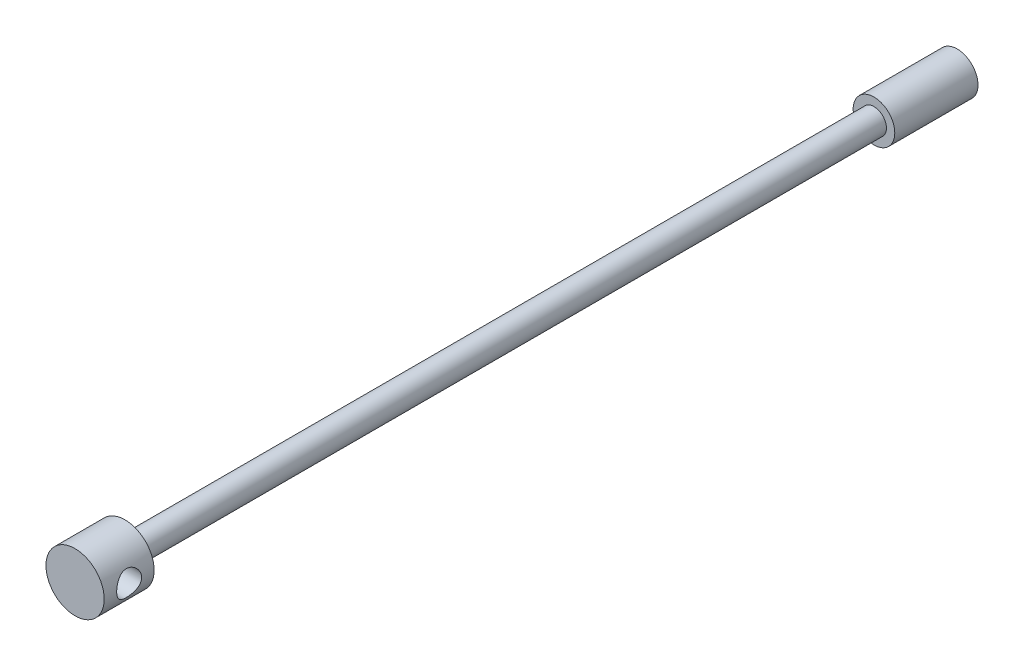
ISO-10303-21;
HEADER;
FILE_DESCRIPTION(('STEP AP214'),'2;1');
FILE_NAME('part.step','',(''),(''),'','','');
FILE_SCHEMA(('AUTOMOTIVE_DESIGN { 1 0 10303 214 1 1 1 1 }'));
ENDSEC;
DATA;
#1=APPLICATION_CONTEXT('core data for automotive mechanical design processes');
#2=APPLICATION_PROTOCOL_DEFINITION('international standard','automotive_design',2000,#1);
#3=PRODUCT_CONTEXT('',#1,'mechanical');
#4=PRODUCT('Part','Part','',(#3));
#5=PRODUCT_RELATED_PRODUCT_CATEGORY('part','',(#4));
#6=PRODUCT_DEFINITION_FORMATION('','',#4);
#7=PRODUCT_DEFINITION_CONTEXT('part definition',#1,'design');
#8=PRODUCT_DEFINITION('design','',#6,#7);
#9=PRODUCT_DEFINITION_SHAPE('','',#8);
#10=(LENGTH_UNIT() NAMED_UNIT(*) SI_UNIT(.MILLI.,.METRE.));
#11=(NAMED_UNIT(*) PLANE_ANGLE_UNIT() SI_UNIT($,.RADIAN.));
#12=(NAMED_UNIT(*) SI_UNIT($,.STERADIAN.) SOLID_ANGLE_UNIT());
#13=UNCERTAINTY_MEASURE_WITH_UNIT(LENGTH_MEASURE(1.E-05),#10,'distance_accuracy_value','');
#14=(GEOMETRIC_REPRESENTATION_CONTEXT(3) GLOBAL_UNCERTAINTY_ASSIGNED_CONTEXT((#13)) GLOBAL_UNIT_ASSIGNED_CONTEXT((#10,
#11,#12)) REPRESENTATION_CONTEXT('',''));
#15=CARTESIAN_POINT('',(0.,0.,0.));
#16=DIRECTION('',(0.,0.,1.));
#17=DIRECTION('',(1.,0.,0.));
#18=AXIS2_PLACEMENT_3D('',#15,#16,#17);
#19=CARTESIAN_POINT('',(0.,0.,50.));
#20=DIRECTION('',(0.,0.,-1.));
#21=DIRECTION('',(-1.,0.,0.));
#22=AXIS2_PLACEMENT_3D('',#19,#20,#21);
#23=CYLINDRICAL_SURFACE('',#22,1.25);
#24=CARTESIAN_POINT('',(0.,0.,0.));
#25=DIRECTION('',(0.,0.,1.));
#26=DIRECTION('',(1.,0.,0.));
#27=AXIS2_PLACEMENT_3D('',#24,#25,#26);
#28=CIRCLE('',#27,1.25);
#29=CARTESIAN_POINT('',(1.25,0.,0.));
#30=VERTEX_POINT('',#29);
#31=EDGE_CURVE('E60',#30,#30,#28,.T.);
#32=ORIENTED_EDGE('',*,*,#31,.T.);
#33=EDGE_LOOP('',(#32));
#34=FACE_BOUND('',#33,.T.);
#35=CARTESIAN_POINT('',(0.,0.,5.));
#36=DIRECTION('',(0.,0.,1.));
#37=DIRECTION('',(1.,0.,0.));
#38=AXIS2_PLACEMENT_3D('',#35,#36,#37);
#39=CIRCLE('',#38,1.25);
#40=CARTESIAN_POINT('',(1.25,0.,5.));
#41=VERTEX_POINT('',#40);
#42=EDGE_CURVE('E65',#41,#41,#39,.T.);
#43=ORIENTED_EDGE('',*,*,#42,.F.);
#44=EDGE_LOOP('',(#43));
#45=FACE_BOUND('',#44,.T.);
#46=ADVANCED_FACE('F43',(#34,#45),#23,.T.);
#47=CARTESIAN_POINT('',(0.,0.,0.));
#48=DIRECTION('',(0.,0.,1.));
#49=DIRECTION('',(1.,0.,0.));
#50=AXIS2_PLACEMENT_3D('',#47,#48,#49);
#51=PLANE('',#50);
#52=ORIENTED_EDGE('',*,*,#31,.F.);
#53=EDGE_LOOP('',(#52));
#54=FACE_BOUND('',#53,.T.);
#55=ADVANCED_FACE('F92',(#54),#51,.F.);
#56=CARTESIAN_POINT('',(0.,0.,5.));
#57=DIRECTION('',(0.,0.,1.));
#58=DIRECTION('',(1.,0.,0.));
#59=AXIS2_PLACEMENT_3D('',#56,#57,#58);
#60=PLANE('',#59);
#61=CARTESIAN_POINT('',(0.,0.,5.));
#62=DIRECTION('',(0.,0.,1.));
#63=DIRECTION('',(1.,0.,0.));
#64=AXIS2_PLACEMENT_3D('',#61,#62,#63);
#65=CIRCLE('',#64,0.75);
#66=CARTESIAN_POINT('',(0.75,0.,5.));
#67=VERTEX_POINT('',#66);
#68=EDGE_CURVE('E105',#67,#67,#65,.T.);
#69=ORIENTED_EDGE('',*,*,#68,.F.);
#70=EDGE_LOOP('',(#69));
#71=FACE_BOUND('',#70,.T.);
#72=ORIENTED_EDGE('',*,*,#42,.T.);
#73=EDGE_LOOP('',(#72));
#74=FACE_BOUND('',#73,.T.);
#75=ADVANCED_FACE('F97',(#71,#74),#60,.T.);
#76=CARTESIAN_POINT('',(0.,0.,5.));
#77=DIRECTION('',(0.,0.,1.));
#78=DIRECTION('',(1.,0.,0.));
#79=AXIS2_PLACEMENT_3D('',#76,#77,#78);
#80=CYLINDRICAL_SURFACE('',#79,0.75);
#81=ORIENTED_EDGE('',*,*,#68,.T.);
#82=EDGE_LOOP('',(#81));
#83=FACE_BOUND('',#82,.T.);
#84=CARTESIAN_POINT('',(0.,0.,50.));
#85=DIRECTION('',(0.,0.,1.));
#86=DIRECTION('',(1.,0.,0.));
#87=AXIS2_PLACEMENT_3D('',#84,#85,#86);
#88=CIRCLE('',#87,0.75);
#89=CARTESIAN_POINT('',(0.75,0.,50.));
#90=VERTEX_POINT('',#89);
#91=EDGE_CURVE('E108',#90,#90,#88,.T.);
#92=ORIENTED_EDGE('',*,*,#91,.F.);
#93=EDGE_LOOP('',(#92));
#94=FACE_BOUND('',#93,.T.);
#95=ADVANCED_FACE('F124',(#83,#94),#80,.T.);
#96=CARTESIAN_POINT('',(0.,0.,53.));
#97=DIRECTION('',(0.,0.,-1.));
#98=DIRECTION('',(-1.,0.,0.));
#99=AXIS2_PLACEMENT_3D('',#96,#97,#98);
#100=CYLINDRICAL_SURFACE('',#99,1.75);
#101=CARTESIAN_POINT('',(-1.75,0.,50.75));
#102=CARTESIAN_POINT('',(-1.74999649634442,0.0400760988412034,50.7500046107195));
#103=CARTESIAN_POINT('',(-1.74860758204855,0.0802099960991227,50.7532310648778));
#104=CARTESIAN_POINT('',(-1.74318534602433,0.159335805680608,50.7660198536427));
#105=CARTESIAN_POINT('',(-1.73914534804376,0.19832457454529,50.7755981848948));
#106=CARTESIAN_POINT('',(-1.72885393168354,0.273884082373206,50.8006676375995));
#107=CARTESIAN_POINT('',(-1.72261018411933,0.310462693073368,50.8161382637313));
#108=CARTESIAN_POINT('',(-1.7085141896341,0.380468223035943,50.8524660518752));
#109=CARTESIAN_POINT('',(-1.7006623786042,0.413895992805709,50.8733217545755));
#110=CARTESIAN_POINT('',(-1.68366954351467,0.478460391773065,50.9209819270627));
#111=CARTESIAN_POINT('',(-1.67448473690607,0.509410122126232,50.9480238190388));
#112=CARTESIAN_POINT('',(-1.65604413884845,0.566497592184653,51.0067859630581));
#113=CARTESIAN_POINT('',(-1.64678831093961,0.592632660278324,51.0385087950351));
#114=CARTESIAN_POINT('',(-1.62870513731182,0.64071421774093,51.1077581818533));
#115=CARTESIAN_POINT('',(-1.6199261503825,0.662367030030072,51.1455026148212));
#116=CARTESIAN_POINT('',(-1.60449042181725,0.698932997872122,51.2245273567335));
#117=CARTESIAN_POINT('',(-1.59783252535351,0.71384982268682,51.2658057260401));
#118=CARTESIAN_POINT('',(-1.58786949766768,0.73573729995718,51.3485751846547));
#119=CARTESIAN_POINT('',(-1.58441305359909,0.743068736048471,51.3899519254637));
#120=CARTESIAN_POINT('',(-1.5808121242101,0.750701517851979,51.4734814923838));
#121=CARTESIAN_POINT('',(-1.58066565647151,0.751007071522823,51.515633838825));
#122=CARTESIAN_POINT('',(-1.58357393484011,0.744849998790477,51.5958249759244));
#123=CARTESIAN_POINT('',(-1.58636717763804,0.738940284554133,51.6339176558031));
#124=CARTESIAN_POINT('',(-1.59439602910728,0.721451932032641,51.7085068964445));
#125=CARTESIAN_POINT('',(-1.59963213825155,0.709872132086116,51.7450031284644));
#126=CARTESIAN_POINT('',(-1.61207671405222,0.681144147673288,51.8163117878689));
#127=CARTESIAN_POINT('',(-1.61932573775524,0.663879936070139,51.8510700735573));
#128=CARTESIAN_POINT('',(-1.63497123472857,0.624355762183455,51.9173365810146));
#129=CARTESIAN_POINT('',(-1.64336817399055,0.602093768701478,51.9488434737316));
#130=CARTESIAN_POINT('',(-1.66128101133097,0.55085851348029,52.0106943759062));
#131=CARTESIAN_POINT('',(-1.67082963847113,0.521461822140256,52.0406791823682));
#132=CARTESIAN_POINT('',(-1.6893365143982,0.457968331012764,52.0954178976638));
#133=CARTESIAN_POINT('',(-1.69829460813714,0.423870304069991,52.1201704364695));
#134=CARTESIAN_POINT('',(-1.7148992342234,0.350796455753154,52.1643109832018));
#135=CARTESIAN_POINT('',(-1.72250613758418,0.31171778742557,52.1835447546764));
#136=CARTESIAN_POINT('',(-1.73524349065154,0.230469923539736,52.2150375594037));
#137=CARTESIAN_POINT('',(-1.74037539009999,0.188302553914414,52.2273006764944));
#138=CARTESIAN_POINT('',(-1.74730881723343,0.10506905973534,52.2437334651148));
#139=CARTESIAN_POINT('',(-1.74930812491146,0.0641144902527329,52.2483846913286));
#140=CARTESIAN_POINT('',(-1.75038854162935,-0.0180358252796324,52.2509073941021));
#141=CARTESIAN_POINT('',(-1.74947055132917,-0.0592314929751565,52.2487809631331));
#142=CARTESIAN_POINT('',(-1.74494669080038,-0.138385609906654,52.2381460919863));
#143=CARTESIAN_POINT('',(-1.74148629868411,-0.176399732876001,52.2299829196379));
#144=CARTESIAN_POINT('',(-1.73238472002493,-0.250472784098164,52.2079947764405));
#145=CARTESIAN_POINT('',(-1.72674326212128,-0.286531468425218,52.1941691010695));
#146=CARTESIAN_POINT('',(-1.71359687878432,-0.356944241309503,52.1607997101244));
#147=CARTESIAN_POINT('',(-1.70603926347127,-0.391209937378767,52.1410909174432));
#148=CARTESIAN_POINT('',(-1.68985747097851,-0.45607122641259,52.0966952638813));
#149=CARTESIAN_POINT('',(-1.68123283912156,-0.486665243785568,52.0720062779953));
#150=CARTESIAN_POINT('',(-1.66303697174512,-0.545741898828171,52.0161776030381));
#151=CARTESIAN_POINT('',(-1.65344338749786,-0.573891543871396,51.9846919474801));
#152=CARTESIAN_POINT('',(-1.63496009422425,-0.624608578622012,51.9173044253467));
#153=CARTESIAN_POINT('',(-1.6260705813868,-0.647174416100965,51.8814013349235));
#154=CARTESIAN_POINT('',(-1.60990742321858,-0.686409689031921,51.8052965367428));
#155=CARTESIAN_POINT('',(-1.60266563998847,-0.702966037366767,51.7650292476716));
#156=CARTESIAN_POINT('',(-1.59103401880552,-0.728914712754464,51.681868418381));
#157=CARTESIAN_POINT('',(-1.58664164494417,-0.738313411249904,51.6389772506647));
#158=CARTESIAN_POINT('',(-1.58160870290968,-0.749029870419521,51.5555022066907));
#159=CARTESIAN_POINT('',(-1.5806948144084,-0.750936730831215,51.5150101823101));
#160=CARTESIAN_POINT('',(-1.58198904543376,-0.748206625428955,51.4343025640842));
#161=CARTESIAN_POINT('',(-1.58419661433492,-0.743570813743426,51.3940869227424));
#162=CARTESIAN_POINT('',(-1.59122913559015,-0.728391070497186,51.3172395730669));
#163=CARTESIAN_POINT('',(-1.59591178589159,-0.718167410066894,51.2805302916763));
#164=CARTESIAN_POINT('',(-1.60724718643595,-0.692425585002179,51.209344818913));
#165=CARTESIAN_POINT('',(-1.61390049674776,-0.676905915031192,51.1748692657734));
#166=CARTESIAN_POINT('',(-1.6289381307548,-0.639908011135108,51.1067947815459));
#167=CARTESIAN_POINT('',(-1.63740417169815,-0.618120138563838,51.0733825530899));
#168=CARTESIAN_POINT('',(-1.6548993995427,-0.569624444406523,51.0105045682346));
#169=CARTESIAN_POINT('',(-1.66392879850324,-0.542914762671466,50.981040311228));
#170=CARTESIAN_POINT('',(-1.68238875438572,-0.482835837770873,50.9244984513428));
#171=CARTESIAN_POINT('',(-1.69179474455969,-0.44910740899067,50.8977926330657));
#172=CARTESIAN_POINT('',(-1.70924044624734,-0.377306306853467,50.8503925366534));
#173=CARTESIAN_POINT('',(-1.71727953761294,-0.339231674691355,50.8297009841251));
#174=CARTESIAN_POINT('',(-1.73098756818427,-0.260313401448285,50.7953277152147));
#175=CARTESIAN_POINT('',(-1.73668934160144,-0.219518201429098,50.7815482350104));
#176=CARTESIAN_POINT('',(-1.74521147745704,-0.135962828702168,50.7611826426164));
#177=CARTESIAN_POINT('',(-1.74804076481543,-0.0932091763556619,50.7545742451767));
#178=CARTESIAN_POINT('',(-1.74976057906193,-0.0335133803066094,50.750559744523));
#179=CARTESIAN_POINT('',(-1.75000146539671,-0.0167617455303751,50.7499980715761));
#180=CARTESIAN_POINT('',(-1.75,0.,50.75));
#181=B_SPLINE_CURVE_WITH_KNOTS('',3,(#101,#102,#103,#104,#105,#106,#107,#108,#109,#110,#111,
#112,#113,#114,#115,#116,#117,#118,#119,#120,#121,#122,#123,#124,#125,#126,#127,#128,#129,#130,
#131,#132,#133,#134,#135,#136,#137,#138,#139,#140,#141,#142,#143,#144,#145,#146,#147,#148,#149,
#150,#151,#152,#153,#154,#155,#156,#157,#158,#159,#160,#161,#162,#163,#164,#165,#166,#167,#168,
#169,#170,#171,#172,#173,#174,#175,#176,#177,#178,#179,#180),.UNSPECIFIED.,.T.,.F.,(4,2,2,2,2,2,
2,2,2,2,2,2,2,2,2,2,2,2,2,2,2,2,2,2,2,2,2,2,2,2,2,2,2,2,2,2,2,2,2,4),(0.,0.120178580687213,
0.240660975855837,0.360728065687852,0.480762652403827,0.606556858896269,0.732420658554359,
0.864923902150158,0.997354880570659,1.12314856707024,1.24886691094478,1.36427680079903,
1.47971034520608,1.597663522162,1.71566472471192,1.84427459429581,1.97291809775362,
2.10486811148429,2.23674074089306,2.35989336873627,2.48300797925513,2.59957798556529,
2.71616249978561,2.83638763788672,2.95666418394144,3.086007125948,3.21538598337741,
3.34708672697466,3.47867009856474,3.59967122216288,3.72065100381071,3.83533011275471,
3.95004184525161,4.07186187519778,4.19372804060038,4.32521042333479,4.45675230003527,
4.58637713908482,4.71559798494526,4.76586242799054),.UNSPECIFIED.);
#182=CARTESIAN_POINT('',(-1.75,0.,50.75));
#183=VERTEX_POINT('',#182);
#184=EDGE_CURVE('E10',#183,#183,#181,.T.);
#185=ORIENTED_EDGE('',*,*,#184,.T.);
#186=EDGE_LOOP('',(#185));
#187=FACE_BOUND('',#186,.T.);
#188=CARTESIAN_POINT('',(1.75,0.,50.75));
#189=CARTESIAN_POINT('',(1.74999649634442,-0.0400760988412034,50.7500046107195));
#190=CARTESIAN_POINT('',(1.74860758204855,-0.0802099960991227,50.7532310648778));
#191=CARTESIAN_POINT('',(1.74318534602433,-0.159335805680608,50.7660198536427));
#192=CARTESIAN_POINT('',(1.73914534804376,-0.19832457454529,50.7755981848948));
#193=CARTESIAN_POINT('',(1.72885393168354,-0.273884082373206,50.8006676375995));
#194=CARTESIAN_POINT('',(1.72261018411933,-0.310462693073368,50.8161382637313));
#195=CARTESIAN_POINT('',(1.7085141896341,-0.380468223035943,50.8524660518752));
#196=CARTESIAN_POINT('',(1.7006623786042,-0.413895992805709,50.8733217545755));
#197=CARTESIAN_POINT('',(1.68366954351467,-0.478460391773065,50.9209819270627));
#198=CARTESIAN_POINT('',(1.67448473690607,-0.509410122126232,50.9480238190388));
#199=CARTESIAN_POINT('',(1.65604413884845,-0.566497592184653,51.0067859630581));
#200=CARTESIAN_POINT('',(1.64678831093961,-0.592632660278324,51.0385087950351));
#201=CARTESIAN_POINT('',(1.62870513731182,-0.64071421774093,51.1077581818533));
#202=CARTESIAN_POINT('',(1.6199261503825,-0.662367030030072,51.1455026148212));
#203=CARTESIAN_POINT('',(1.60449042181725,-0.698932997872122,51.2245273567335));
#204=CARTESIAN_POINT('',(1.59783252535351,-0.71384982268682,51.2658057260401));
#205=CARTESIAN_POINT('',(1.58786949766768,-0.73573729995718,51.3485751846547));
#206=CARTESIAN_POINT('',(1.58441305359909,-0.743068736048471,51.3899519254637));
#207=CARTESIAN_POINT('',(1.5808121242101,-0.750701517851979,51.4734814923838));
#208=CARTESIAN_POINT('',(1.58066565647151,-0.751007071522823,51.515633838825));
#209=CARTESIAN_POINT('',(1.58357393484011,-0.744849998790477,51.5958249759244));
#210=CARTESIAN_POINT('',(1.58636717763804,-0.738940284554133,51.6339176558031));
#211=CARTESIAN_POINT('',(1.59439602910728,-0.721451932032641,51.7085068964445));
#212=CARTESIAN_POINT('',(1.59963213825155,-0.709872132086116,51.7450031284644));
#213=CARTESIAN_POINT('',(1.61207671405222,-0.681144147673288,51.8163117878689));
#214=CARTESIAN_POINT('',(1.61932573775524,-0.663879936070139,51.8510700735573));
#215=CARTESIAN_POINT('',(1.63497123472857,-0.624355762183455,51.9173365810146));
#216=CARTESIAN_POINT('',(1.64336817399055,-0.602093768701478,51.9488434737316));
#217=CARTESIAN_POINT('',(1.66128101133097,-0.55085851348029,52.0106943759062));
#218=CARTESIAN_POINT('',(1.67082963847113,-0.521461822140256,52.0406791823682));
#219=CARTESIAN_POINT('',(1.6893365143982,-0.457968331012764,52.0954178976638));
#220=CARTESIAN_POINT('',(1.69829460813714,-0.423870304069991,52.1201704364695));
#221=CARTESIAN_POINT('',(1.7148992342234,-0.350796455753154,52.1643109832018));
#222=CARTESIAN_POINT('',(1.72250613758418,-0.31171778742557,52.1835447546764));
#223=CARTESIAN_POINT('',(1.73524349065154,-0.230469923539736,52.2150375594037));
#224=CARTESIAN_POINT('',(1.74037539009999,-0.188302553914414,52.2273006764944));
#225=CARTESIAN_POINT('',(1.74730881723343,-0.10506905973534,52.2437334651148));
#226=CARTESIAN_POINT('',(1.74930812491146,-0.0641144902527329,52.2483846913286));
#227=CARTESIAN_POINT('',(1.75038854162935,0.0180358252796324,52.2509073941021));
#228=CARTESIAN_POINT('',(1.74947055132917,0.0592314929751565,52.2487809631331));
#229=CARTESIAN_POINT('',(1.74494669080038,0.138385609906654,52.2381460919863));
#230=CARTESIAN_POINT('',(1.74148629868411,0.176399732876001,52.2299829196379));
#231=CARTESIAN_POINT('',(1.73238472002493,0.250472784098164,52.2079947764405));
#232=CARTESIAN_POINT('',(1.72674326212128,0.286531468425218,52.1941691010695));
#233=CARTESIAN_POINT('',(1.71359687878432,0.356944241309503,52.1607997101244));
#234=CARTESIAN_POINT('',(1.70603926347127,0.391209937378767,52.1410909174432));
#235=CARTESIAN_POINT('',(1.68985747097851,0.45607122641259,52.0966952638813));
#236=CARTESIAN_POINT('',(1.68123283912156,0.486665243785568,52.0720062779953));
#237=CARTESIAN_POINT('',(1.66303697174512,0.545741898828171,52.0161776030381));
#238=CARTESIAN_POINT('',(1.65344338749786,0.573891543871396,51.9846919474801));
#239=CARTESIAN_POINT('',(1.63496009422425,0.624608578622012,51.9173044253467));
#240=CARTESIAN_POINT('',(1.6260705813868,0.647174416100965,51.8814013349235));
#241=CARTESIAN_POINT('',(1.60990742321858,0.686409689031921,51.8052965367428));
#242=CARTESIAN_POINT('',(1.60266563998847,0.702966037366767,51.7650292476716));
#243=CARTESIAN_POINT('',(1.59103401880552,0.728914712754464,51.681868418381));
#244=CARTESIAN_POINT('',(1.58664164494417,0.738313411249904,51.6389772506647));
#245=CARTESIAN_POINT('',(1.58160870290968,0.749029870419521,51.5555022066907));
#246=CARTESIAN_POINT('',(1.5806948144084,0.750936730831215,51.5150101823101));
#247=CARTESIAN_POINT('',(1.58198904543376,0.748206625428955,51.4343025640842));
#248=CARTESIAN_POINT('',(1.58419661433492,0.743570813743426,51.3940869227424));
#249=CARTESIAN_POINT('',(1.59122913559015,0.728391070497186,51.3172395730669));
#250=CARTESIAN_POINT('',(1.59591178589159,0.718167410066894,51.2805302916763));
#251=CARTESIAN_POINT('',(1.60724718643595,0.692425585002179,51.209344818913));
#252=CARTESIAN_POINT('',(1.61390049674776,0.676905915031192,51.1748692657734));
#253=CARTESIAN_POINT('',(1.6289381307548,0.639908011135108,51.1067947815459));
#254=CARTESIAN_POINT('',(1.63740417169815,0.618120138563838,51.0733825530899));
#255=CARTESIAN_POINT('',(1.6548993995427,0.569624444406523,51.0105045682346));
#256=CARTESIAN_POINT('',(1.66392879850324,0.542914762671466,50.981040311228));
#257=CARTESIAN_POINT('',(1.68238875438572,0.482835837770873,50.9244984513428));
#258=CARTESIAN_POINT('',(1.69179474455969,0.44910740899067,50.8977926330657));
#259=CARTESIAN_POINT('',(1.70924044624734,0.377306306853467,50.8503925366534));
#260=CARTESIAN_POINT('',(1.71727953761294,0.339231674691355,50.8297009841251));
#261=CARTESIAN_POINT('',(1.73098756818427,0.260313401448285,50.7953277152147));
#262=CARTESIAN_POINT('',(1.73668934160144,0.219518201429098,50.7815482350104));
#263=CARTESIAN_POINT('',(1.74521147745704,0.135962828702168,50.7611826426164));
#264=CARTESIAN_POINT('',(1.74804076481543,0.0932091763556619,50.7545742451767));
#265=CARTESIAN_POINT('',(1.74976057906193,0.0335133803066094,50.750559744523));
#266=CARTESIAN_POINT('',(1.75000146539671,0.0167617455303751,50.7499980715761));
#267=CARTESIAN_POINT('',(1.75,0.,50.75));
#268=B_SPLINE_CURVE_WITH_KNOTS('',3,(#188,#189,#190,#191,#192,#193,#194,#195,#196,#197,#198,
#199,#200,#201,#202,#203,#204,#205,#206,#207,#208,#209,#210,#211,#212,#213,#214,#215,#216,#217,
#218,#219,#220,#221,#222,#223,#224,#225,#226,#227,#228,#229,#230,#231,#232,#233,#234,#235,#236,
#237,#238,#239,#240,#241,#242,#243,#244,#245,#246,#247,#248,#249,#250,#251,#252,#253,#254,#255,
#256,#257,#258,#259,#260,#261,#262,#263,#264,#265,#266,#267),.UNSPECIFIED.,.T.,.F.,(4,2,2,2,2,2,
2,2,2,2,2,2,2,2,2,2,2,2,2,2,2,2,2,2,2,2,2,2,2,2,2,2,2,2,2,2,2,2,2,4),(0.,0.120178580687213,
0.240660975855837,0.360728065687852,0.480762652403827,0.606556858896269,0.732420658554359,
0.864923902150158,0.997354880570659,1.12314856707024,1.24886691094478,1.36427680079903,
1.47971034520608,1.597663522162,1.71566472471192,1.84427459429581,1.97291809775362,
2.10486811148429,2.23674074089306,2.35989336873627,2.48300797925513,2.59957798556529,
2.71616249978561,2.83638763788672,2.95666418394144,3.086007125948,3.21538598337741,
3.34708672697466,3.47867009856474,3.59967122216288,3.72065100381071,3.83533011275471,
3.95004184525161,4.07186187519778,4.19372804060038,4.32521042333479,4.45675230003527,
4.58637713908482,4.71559798494526,4.76586242799054),.UNSPECIFIED.);
#269=CARTESIAN_POINT('',(1.75,0.,50.75));
#270=VERTEX_POINT('',#269);
#271=EDGE_CURVE('E55',#270,#270,#268,.T.);
#272=ORIENTED_EDGE('',*,*,#271,.T.);
#273=EDGE_LOOP('',(#272));
#274=FACE_BOUND('',#273,.T.);
#275=CARTESIAN_POINT('',(0.,0.,53.));
#276=DIRECTION('',(0.,0.,1.));
#277=DIRECTION('',(1.,0.,0.));
#278=AXIS2_PLACEMENT_3D('',#275,#276,#277);
#279=CIRCLE('',#278,1.75);
#280=CARTESIAN_POINT('',(1.75,0.,53.));
#281=VERTEX_POINT('',#280);
#282=EDGE_CURVE('E112',#281,#281,#279,.T.);
#283=ORIENTED_EDGE('',*,*,#282,.F.);
#284=EDGE_LOOP('',(#283));
#285=FACE_BOUND('',#284,.T.);
#286=CARTESIAN_POINT('',(0.,0.,50.));
#287=DIRECTION('',(0.,0.,1.));
#288=DIRECTION('',(1.,0.,0.));
#289=AXIS2_PLACEMENT_3D('',#286,#287,#288);
#290=CIRCLE('',#289,1.75);
#291=CARTESIAN_POINT('',(1.75,0.,50.));
#292=VERTEX_POINT('',#291);
#293=EDGE_CURVE('E114',#292,#292,#290,.T.);
#294=ORIENTED_EDGE('',*,*,#293,.T.);
#295=EDGE_LOOP('',(#294));
#296=FACE_BOUND('',#295,.T.);
#297=ADVANCED_FACE('F71',(#187,#274,#285,#296),#100,.T.);
#298=CARTESIAN_POINT('',(0.,0.,53.));
#299=DIRECTION('',(0.,0.,1.));
#300=DIRECTION('',(1.,0.,0.));
#301=AXIS2_PLACEMENT_3D('',#298,#299,#300);
#302=PLANE('',#301);
#303=ORIENTED_EDGE('',*,*,#282,.T.);
#304=EDGE_LOOP('',(#303));
#305=FACE_BOUND('',#304,.T.);
#306=ADVANCED_FACE('F81',(#305),#302,.T.);
#307=CARTESIAN_POINT('',(0.,0.,50.));
#308=DIRECTION('',(0.,0.,1.));
#309=DIRECTION('',(1.,0.,0.));
#310=AXIS2_PLACEMENT_3D('',#307,#308,#309);
#311=PLANE('',#310);
#312=ORIENTED_EDGE('',*,*,#91,.T.);
#313=EDGE_LOOP('',(#312));
#314=FACE_BOUND('',#313,.T.);
#315=ORIENTED_EDGE('',*,*,#293,.F.);
#316=EDGE_LOOP('',(#315));
#317=FACE_BOUND('',#316,.T.);
#318=ADVANCED_FACE('F79',(#314,#317),#311,.F.);
#319=CARTESIAN_POINT('',(-1.75,0.,51.5));
#320=DIRECTION('',(1.,0.,0.));
#321=DIRECTION('',(0.,0.,-1.));
#322=AXIS2_PLACEMENT_3D('',#319,#320,#321);
#323=CYLINDRICAL_SURFACE('',#322,0.749999999999999);
#324=ORIENTED_EDGE('',*,*,#271,.F.);
#325=EDGE_LOOP('',(#324));
#326=FACE_BOUND('',#325,.T.);
#327=ORIENTED_EDGE('',*,*,#184,.F.);
#328=EDGE_LOOP('',(#327));
#329=FACE_BOUND('',#328,.T.);
#330=ADVANCED_FACE('F75',(#326,#329),#323,.F.);
#331=CLOSED_SHELL('',(#46,#55,#75,#95,#297,#306,#318,#330));
#332=MANIFOLD_SOLID_BREP('B2',#331);
#333=ADVANCED_BREP_SHAPE_REPRESENTATION('',(#18,#332),#14);
#334=SHAPE_DEFINITION_REPRESENTATION(#9,#333);
ENDSEC;
END-ISO-10303-21;
